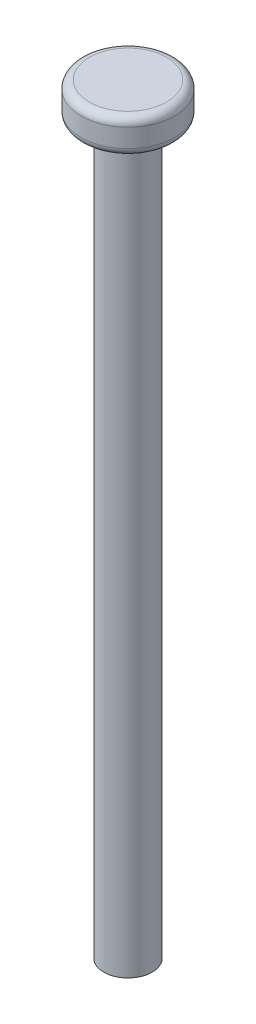
ISO-10303-21;
HEADER;
FILE_DESCRIPTION(('STEP AP214'),'2;1');
FILE_NAME('part.step','',(''),(''),'','','');
FILE_SCHEMA(('AUTOMOTIVE_DESIGN { 1 0 10303 214 1 1 1 1 }'));
ENDSEC;
DATA;
#1=APPLICATION_CONTEXT('core data for automotive mechanical design processes');
#2=APPLICATION_PROTOCOL_DEFINITION('international standard','automotive_design',2000,#1);
#3=PRODUCT_CONTEXT('',#1,'mechanical');
#4=PRODUCT('Part','Part','',(#3));
#5=PRODUCT_RELATED_PRODUCT_CATEGORY('part','',(#4));
#6=PRODUCT_DEFINITION_FORMATION('','',#4);
#7=PRODUCT_DEFINITION_CONTEXT('part definition',#1,'design');
#8=PRODUCT_DEFINITION('design','',#6,#7);
#9=PRODUCT_DEFINITION_SHAPE('','',#8);
#10=(LENGTH_UNIT() NAMED_UNIT(*) SI_UNIT(.MILLI.,.METRE.));
#11=(NAMED_UNIT(*) PLANE_ANGLE_UNIT() SI_UNIT($,.RADIAN.));
#12=(NAMED_UNIT(*) SI_UNIT($,.STERADIAN.) SOLID_ANGLE_UNIT());
#13=UNCERTAINTY_MEASURE_WITH_UNIT(LENGTH_MEASURE(1.E-05),#10,'distance_accuracy_value','');
#14=(GEOMETRIC_REPRESENTATION_CONTEXT(3) GLOBAL_UNCERTAINTY_ASSIGNED_CONTEXT((#13)) GLOBAL_UNIT_ASSIGNED_CONTEXT((#10,
#11,#12)) REPRESENTATION_CONTEXT('',''));
#15=CARTESIAN_POINT('',(0.,0.,0.));
#16=DIRECTION('',(0.,0.,1.));
#17=DIRECTION('',(1.,0.,0.));
#18=AXIS2_PLACEMENT_3D('',#15,#16,#17);
#19=CARTESIAN_POINT('',(0.,90.,0.));
#20=DIRECTION('',(0.,-1.,0.));
#21=DIRECTION('',(0.,0.,-1.));
#22=AXIS2_PLACEMENT_3D('',#19,#20,#21);
#23=CYLINDRICAL_SURFACE('',#22,3.);
#24=CARTESIAN_POINT('',(0.,90.,0.));
#25=DIRECTION('',(0.,1.,0.));
#26=DIRECTION('',(0.,0.,1.));
#27=AXIS2_PLACEMENT_3D('',#24,#25,#26);
#28=CIRCLE('',#27,3.);
#29=CARTESIAN_POINT('',(0.,90.,3.));
#30=VERTEX_POINT('',#29);
#31=EDGE_CURVE('E53',#30,#30,#28,.T.);
#32=ORIENTED_EDGE('',*,*,#31,.F.);
#33=EDGE_LOOP('',(#32));
#34=FACE_BOUND('',#33,.T.);
#35=CARTESIAN_POINT('',(0.,0.,0.));
#36=DIRECTION('',(0.,1.,0.));
#37=DIRECTION('',(0.,0.,1.));
#38=AXIS2_PLACEMENT_3D('',#35,#36,#37);
#39=CIRCLE('',#38,3.);
#40=CARTESIAN_POINT('',(0.,0.,3.));
#41=VERTEX_POINT('',#40);
#42=EDGE_CURVE('E54',#41,#41,#39,.T.);
#43=ORIENTED_EDGE('',*,*,#42,.T.);
#44=EDGE_LOOP('',(#43));
#45=FACE_BOUND('',#44,.T.);
#46=ADVANCED_FACE('F33',(#34,#45),#23,.T.);
#47=CARTESIAN_POINT('',(0.,0.,0.));
#48=DIRECTION('',(0.,1.,0.));
#49=DIRECTION('',(0.,0.,1.));
#50=AXIS2_PLACEMENT_3D('',#47,#48,#49);
#51=PLANE('',#50);
#52=ORIENTED_EDGE('',*,*,#42,.F.);
#53=EDGE_LOOP('',(#52));
#54=FACE_BOUND('',#53,.T.);
#55=ADVANCED_FACE('F64',(#54),#51,.F.);
#56=CARTESIAN_POINT('',(0.,94.3,0.));
#57=DIRECTION('',(0.,-1.,0.));
#58=DIRECTION('',(0.,0.,-1.));
#59=AXIS2_PLACEMENT_3D('',#56,#57,#58);
#60=CYLINDRICAL_SURFACE('',#59,5.8);
#61=CARTESIAN_POINT('',(0.,91.,0.));
#62=DIRECTION('',(0.,1.,0.));
#63=DIRECTION('',(0.,0.,1.));
#64=AXIS2_PLACEMENT_3D('',#61,#62,#63);
#65=CIRCLE('',#64,5.8);
#66=CARTESIAN_POINT('',(0.,91.,5.8));
#67=VERTEX_POINT('',#66);
#68=EDGE_CURVE('E44',#67,#67,#65,.T.);
#69=ORIENTED_EDGE('',*,*,#68,.T.);
#70=EDGE_LOOP('',(#69));
#71=FACE_BOUND('',#70,.T.);
#72=CARTESIAN_POINT('',(0.,93.3,0.));
#73=DIRECTION('',(0.,1.,0.));
#74=DIRECTION('',(0.,0.,1.));
#75=AXIS2_PLACEMENT_3D('',#72,#73,#74);
#76=CIRCLE('',#75,5.8);
#77=CARTESIAN_POINT('',(0.,93.3,5.8));
#78=VERTEX_POINT('',#77);
#79=EDGE_CURVE('E48',#78,#78,#76,.F.);
#80=ORIENTED_EDGE('',*,*,#79,.T.);
#81=EDGE_LOOP('',(#80));
#82=FACE_BOUND('',#81,.T.);
#83=ADVANCED_FACE('F69',(#71,#82),#60,.T.);
#84=CARTESIAN_POINT('',(0.,94.3,0.));
#85=DIRECTION('',(0.,1.,0.));
#86=DIRECTION('',(0.,0.,1.));
#87=AXIS2_PLACEMENT_3D('',#84,#85,#86);
#88=PLANE('',#87);
#89=CARTESIAN_POINT('',(0.,94.3,0.));
#90=DIRECTION('',(0.,1.,0.));
#91=DIRECTION('',(0.,0.,1.));
#92=AXIS2_PLACEMENT_3D('',#89,#90,#91);
#93=CIRCLE('',#92,4.8);
#94=CARTESIAN_POINT('',(0.,94.3,4.8));
#95=VERTEX_POINT('',#94);
#96=EDGE_CURVE('E10',#95,#95,#93,.T.);
#97=ORIENTED_EDGE('',*,*,#96,.T.);
#98=EDGE_LOOP('',(#97));
#99=FACE_BOUND('',#98,.T.);
#100=ADVANCED_FACE('F74',(#99),#88,.T.);
#101=CARTESIAN_POINT('',(0.,90.,0.));
#102=DIRECTION('',(0.,1.,0.));
#103=DIRECTION('',(0.,0.,1.));
#104=AXIS2_PLACEMENT_3D('',#101,#102,#103);
#105=PLANE('',#104);
#106=CARTESIAN_POINT('',(0.,90.,0.));
#107=DIRECTION('',(0.,1.,0.));
#108=DIRECTION('',(0.,0.,1.));
#109=AXIS2_PLACEMENT_3D('',#106,#107,#108);
#110=CIRCLE('',#109,4.8);
#111=CARTESIAN_POINT('',(0.,90.,4.8));
#112=VERTEX_POINT('',#111);
#113=EDGE_CURVE('E40',#112,#112,#110,.F.);
#114=ORIENTED_EDGE('',*,*,#113,.T.);
#115=EDGE_LOOP('',(#114));
#116=FACE_BOUND('',#115,.T.);
#117=ORIENTED_EDGE('',*,*,#31,.T.);
#118=EDGE_LOOP('',(#117));
#119=FACE_BOUND('',#118,.T.);
#120=ADVANCED_FACE('F60',(#116,#119),#105,.F.);
#121=CARTESIAN_POINT('',(0.,91.,0.));
#122=DIRECTION('',(0.,1.,0.));
#123=DIRECTION('',(0.,0.,1.));
#124=AXIS2_PLACEMENT_3D('',#121,#122,#123);
#125=TOROIDAL_SURFACE('',#124,4.8,1.);
#126=ORIENTED_EDGE('',*,*,#113,.F.);
#127=EDGE_LOOP('',(#126));
#128=FACE_BOUND('',#127,.T.);
#129=ORIENTED_EDGE('',*,*,#68,.F.);
#130=EDGE_LOOP('',(#129));
#131=FACE_BOUND('',#130,.T.);
#132=ADVANCED_FACE('F78',(#128,#131),#125,.T.);
#133=CARTESIAN_POINT('',(0.,93.3,0.));
#134=DIRECTION('',(0.,1.,0.));
#135=DIRECTION('',(0.,0.,1.));
#136=AXIS2_PLACEMENT_3D('',#133,#134,#135);
#137=TOROIDAL_SURFACE('',#136,4.8,1.);
#138=ORIENTED_EDGE('',*,*,#79,.F.);
#139=EDGE_LOOP('',(#138));
#140=FACE_BOUND('',#139,.T.);
#141=ORIENTED_EDGE('',*,*,#96,.F.);
#142=EDGE_LOOP('',(#141));
#143=FACE_BOUND('',#142,.T.);
#144=ADVANCED_FACE('F35',(#140,#143),#137,.T.);
#145=CLOSED_SHELL('',(#46,#55,#83,#100,#120,#132,#144));
#146=MANIFOLD_SOLID_BREP('B2',#145);
#147=ADVANCED_BREP_SHAPE_REPRESENTATION('',(#18,#146),#14);
#148=SHAPE_DEFINITION_REPRESENTATION(#9,#147);
ENDSEC;
END-ISO-10303-21;
